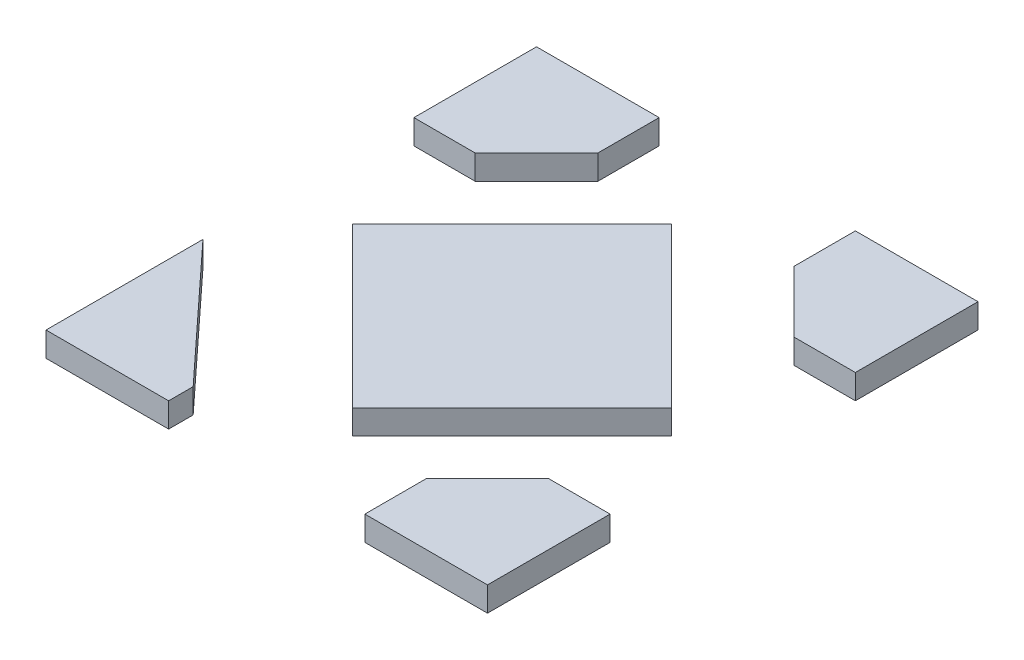
ISO-10303-21;
HEADER;
FILE_DESCRIPTION(('STEP AP214'),'2;1');
FILE_NAME('part.step','',(''),(''),'','','');
FILE_SCHEMA(('AUTOMOTIVE_DESIGN { 1 0 10303 214 1 1 1 1 }'));
ENDSEC;
DATA;
#1=APPLICATION_CONTEXT('core data for automotive mechanical design processes');
#2=APPLICATION_PROTOCOL_DEFINITION('international standard','automotive_design',2000,#1);
#3=PRODUCT_CONTEXT('',#1,'mechanical');
#4=PRODUCT('Part','Part','',(#3));
#5=PRODUCT_RELATED_PRODUCT_CATEGORY('part','',(#4));
#6=PRODUCT_DEFINITION_FORMATION('','',#4);
#7=PRODUCT_DEFINITION_CONTEXT('part definition',#1,'design');
#8=PRODUCT_DEFINITION('design','',#6,#7);
#9=PRODUCT_DEFINITION_SHAPE('','',#8);
#10=(LENGTH_UNIT() NAMED_UNIT(*) SI_UNIT(.MILLI.,.METRE.));
#11=(NAMED_UNIT(*) PLANE_ANGLE_UNIT() SI_UNIT($,.RADIAN.));
#12=(NAMED_UNIT(*) SI_UNIT($,.STERADIAN.) SOLID_ANGLE_UNIT());
#13=UNCERTAINTY_MEASURE_WITH_UNIT(LENGTH_MEASURE(1.E-05),#10,'distance_accuracy_value','');
#14=(GEOMETRIC_REPRESENTATION_CONTEXT(3) GLOBAL_UNCERTAINTY_ASSIGNED_CONTEXT((#13)) GLOBAL_UNIT_ASSIGNED_CONTEXT((#10,
#11,#12)) REPRESENTATION_CONTEXT('',''));
#15=CARTESIAN_POINT('',(0.,0.,0.));
#16=DIRECTION('',(0.,0.,1.));
#17=DIRECTION('',(1.,0.,0.));
#18=AXIS2_PLACEMENT_3D('',#15,#16,#17);
#19=CARTESIAN_POINT('',(-0.2,-0.05,0.450000000000001));
#20=DIRECTION('',(-1.,0.,0.));
#21=DIRECTION('',(0.,0.,1.));
#22=AXIS2_PLACEMENT_3D('',#19,#20,#21);
#23=PLANE('',#22);
#24=DIRECTION('',(0.,0.,1.));
#25=VECTOR('',#24,1.);
#26=CARTESIAN_POINT('',(-0.2,0.,0.450000000000001));
#27=LINE('',#26,#25);
#28=CARTESIAN_POINT('',(-0.2,0.,0.450000000000001));
#29=VERTEX_POINT('',#28);
#30=CARTESIAN_POINT('',(-0.2,0.,0.500000000000001));
#31=VERTEX_POINT('',#30);
#32=EDGE_CURVE('E118',#29,#31,#27,.T.);
#33=ORIENTED_EDGE('',*,*,#32,.T.);
#34=DIRECTION('',(0.,1.,0.));
#35=VECTOR('',#34,1.);
#36=CARTESIAN_POINT('',(-0.2,-0.05,0.500000000000001));
#37=LINE('',#36,#35);
#38=CARTESIAN_POINT('',(-0.2,-0.05,0.500000000000001));
#39=VERTEX_POINT('',#38);
#40=EDGE_CURVE('E12',#39,#31,#37,.T.);
#41=ORIENTED_EDGE('',*,*,#40,.F.);
#42=DIRECTION('',(0.,0.,1.));
#43=VECTOR('',#42,1.);
#44=CARTESIAN_POINT('',(-0.2,-0.05,0.450000000000001));
#45=LINE('',#44,#43);
#46=CARTESIAN_POINT('',(-0.2,-0.05,0.450000000000001));
#47=VERTEX_POINT('',#46);
#48=EDGE_CURVE('E100',#47,#39,#45,.T.);
#49=ORIENTED_EDGE('',*,*,#48,.F.);
#50=DIRECTION('',(0.,1.,0.));
#51=VECTOR('',#50,1.);
#52=CARTESIAN_POINT('',(-0.2,-0.05,0.450000000000001));
#53=LINE('',#52,#51);
#54=EDGE_CURVE('E114',#47,#29,#53,.T.);
#55=ORIENTED_EDGE('',*,*,#54,.T.);
#56=EDGE_LOOP('',(#33,#41,#49,#55));
#57=FACE_BOUND('',#56,.T.);
#58=ADVANCED_FACE('F48',(#57),#23,.F.);
#59=CARTESIAN_POINT('',(-0.45,-0.05,0.500000000000001));
#60=DIRECTION('',(0.,0.,-1.));
#61=DIRECTION('',(-1.,0.,0.));
#62=AXIS2_PLACEMENT_3D('',#59,#60,#61);
#63=PLANE('',#62);
#64=DIRECTION('',(-1.,0.,0.));
#65=VECTOR('',#64,1.);
#66=CARTESIAN_POINT('',(-0.45,0.,0.500000000000001));
#67=LINE('',#66,#65);
#68=CARTESIAN_POINT('',(-0.45,0.,0.500000000000001));
#69=VERTEX_POINT('',#68);
#70=EDGE_CURVE('E105',#31,#69,#67,.T.);
#71=ORIENTED_EDGE('',*,*,#70,.T.);
#72=DIRECTION('',(0.,1.,0.));
#73=VECTOR('',#72,1.);
#74=CARTESIAN_POINT('',(-0.45,-0.05,0.500000000000001));
#75=LINE('',#74,#73);
#76=CARTESIAN_POINT('',(-0.45,-0.05,0.500000000000001));
#77=VERTEX_POINT('',#76);
#78=EDGE_CURVE('E57',#77,#69,#75,.T.);
#79=ORIENTED_EDGE('',*,*,#78,.F.);
#80=DIRECTION('',(-1.,0.,0.));
#81=VECTOR('',#80,1.);
#82=CARTESIAN_POINT('',(-0.45,-0.05,0.500000000000001));
#83=LINE('',#82,#81);
#84=EDGE_CURVE('E95',#39,#77,#83,.T.);
#85=ORIENTED_EDGE('',*,*,#84,.F.);
#86=ORIENTED_EDGE('',*,*,#40,.T.);
#87=EDGE_LOOP('',(#71,#79,#85,#86));
#88=FACE_BOUND('',#87,.T.);
#89=ADVANCED_FACE('F104',(#88),#63,.F.);
#90=CARTESIAN_POINT('',(-0.45,-0.05,0.500000000000001));
#91=DIRECTION('',(1.,0.,0.));
#92=DIRECTION('',(0.,0.,-1.));
#93=AXIS2_PLACEMENT_3D('',#90,#91,#92);
#94=PLANE('',#93);
#95=DIRECTION('',(0.,0.,-1.));
#96=VECTOR('',#95,1.);
#97=CARTESIAN_POINT('',(-0.45,0.,0.500000000000001));
#98=LINE('',#97,#96);
#99=CARTESIAN_POINT('',(-0.449999999999999,0.,0.180000000000001));
#100=VERTEX_POINT('',#99);
#101=EDGE_CURVE('E82',#69,#100,#98,.T.);
#102=ORIENTED_EDGE('',*,*,#101,.T.);
#103=DIRECTION('',(0.,1.,0.));
#104=VECTOR('',#103,1.);
#105=CARTESIAN_POINT('',(-0.449999999999999,-0.05,0.180000000000001));
#106=LINE('',#105,#104);
#107=CARTESIAN_POINT('',(-0.449999999999999,-0.05,0.180000000000001));
#108=VERTEX_POINT('',#107);
#109=EDGE_CURVE('E107',#108,#100,#106,.T.);
#110=ORIENTED_EDGE('',*,*,#109,.F.);
#111=DIRECTION('',(0.,0.,-1.));
#112=VECTOR('',#111,1.);
#113=CARTESIAN_POINT('',(-0.45,-0.05,0.500000000000001));
#114=LINE('',#113,#112);
#115=EDGE_CURVE('E98',#77,#108,#114,.T.);
#116=ORIENTED_EDGE('',*,*,#115,.F.);
#117=ORIENTED_EDGE('',*,*,#78,.T.);
#118=EDGE_LOOP('',(#102,#110,#116,#117));
#119=FACE_BOUND('',#118,.T.);
#120=ADVANCED_FACE('F108',(#119),#94,.F.);
#121=CARTESIAN_POINT('',(-0.449999999999999,-0.05,0.180000000000001));
#122=DIRECTION('',(-0.733760674018171,0.,0.679408031498304));
#123=DIRECTION('',(0.679408031498304,0.,0.733760674018171));
#124=AXIS2_PLACEMENT_3D('',#121,#122,#123);
#125=PLANE('',#124);
#126=DIRECTION('',(0.679408031498303,0.,0.733760674018171));
#127=VECTOR('',#126,1.);
#128=CARTESIAN_POINT('',(-0.449999999999999,0.,0.180000000000001));
#129=LINE('',#128,#127);
#130=EDGE_CURVE('E88',#100,#29,#129,.T.);
#131=ORIENTED_EDGE('',*,*,#130,.T.);
#132=ORIENTED_EDGE('',*,*,#54,.F.);
#133=DIRECTION('',(0.679408031498303,0.,0.733760674018171));
#134=VECTOR('',#133,1.);
#135=CARTESIAN_POINT('',(-0.449999999999999,-0.05,0.180000000000001));
#136=LINE('',#135,#134);
#137=EDGE_CURVE('E65',#108,#47,#136,.T.);
#138=ORIENTED_EDGE('',*,*,#137,.F.);
#139=ORIENTED_EDGE('',*,*,#109,.T.);
#140=EDGE_LOOP('',(#131,#132,#138,#139));
#141=FACE_BOUND('',#140,.T.);
#142=ADVANCED_FACE('F129',(#141),#125,.F.);
#143=CARTESIAN_POINT('',(0.,-0.05,0.));
#144=DIRECTION('',(0.,1.,0.));
#145=DIRECTION('',(0.,0.,1.));
#146=AXIS2_PLACEMENT_3D('',#143,#144,#145);
#147=PLANE('',#146);
#148=ORIENTED_EDGE('',*,*,#48,.T.);
#149=ORIENTED_EDGE('',*,*,#84,.T.);
#150=ORIENTED_EDGE('',*,*,#115,.T.);
#151=ORIENTED_EDGE('',*,*,#137,.T.);
#152=EDGE_LOOP('',(#148,#149,#150,#151));
#153=FACE_BOUND('',#152,.T.);
#154=ADVANCED_FACE('F96',(#153),#147,.F.);
#155=CARTESIAN_POINT('',(0.,0.,0.));
#156=DIRECTION('',(0.,1.,0.));
#157=DIRECTION('',(0.,0.,1.));
#158=AXIS2_PLACEMENT_3D('',#155,#156,#157);
#159=PLANE('',#158);
#160=ORIENTED_EDGE('',*,*,#32,.F.);
#161=ORIENTED_EDGE('',*,*,#130,.F.);
#162=ORIENTED_EDGE('',*,*,#101,.F.);
#163=ORIENTED_EDGE('',*,*,#70,.F.);
#164=EDGE_LOOP('',(#160,#161,#162,#163));
#165=FACE_BOUND('',#164,.T.);
#166=ADVANCED_FACE('F132',(#165),#159,.T.);
#167=CLOSED_SHELL('',(#58,#89,#120,#142,#154,#166));
#168=MANIFOLD_SOLID_BREP('B2',#167);
#169=CARTESIAN_POINT('',(0.45,-0.403553389752961,-0.500000000000001));
#170=DIRECTION('',(-1.,0.,0.));
#171=DIRECTION('',(0.,0.,-1.));
#172=AXIS2_PLACEMENT_3D('',#169,#170,#171);
#173=PLANE('',#172);
#174=DIRECTION('',(0.,0.,-1.));
#175=VECTOR('',#174,1.);
#176=CARTESIAN_POINT('',(0.45,-0.05,-0.500000000000001));
#177=LINE('',#176,#175);
#178=CARTESIAN_POINT('',(0.45,-0.05,-0.250000001188383));
#179=VERTEX_POINT('',#178);
#180=CARTESIAN_POINT('',(0.45,-0.05,-0.500000000000001));
#181=VERTEX_POINT('',#180);
#182=EDGE_CURVE('E276',#179,#181,#177,.T.);
#183=ORIENTED_EDGE('',*,*,#182,.T.);
#184=DIRECTION('',(0.,1.,0.));
#185=VECTOR('',#184,1.);
#186=CARTESIAN_POINT('',(0.45,-0.403553389752961,-0.500000000000001));
#187=LINE('',#186,#185);
#188=CARTESIAN_POINT('',(0.45,0.,-0.500000000000001));
#189=VERTEX_POINT('',#188);
#190=EDGE_CURVE('E285',#181,#189,#187,.T.);
#191=ORIENTED_EDGE('',*,*,#190,.T.);
#192=DIRECTION('',(0.,0.,-1.));
#193=VECTOR('',#192,1.);
#194=CARTESIAN_POINT('',(0.45,0.,-0.500000000000001));
#195=LINE('',#194,#193);
#196=CARTESIAN_POINT('',(0.45,0.,-0.250000001188383));
#197=VERTEX_POINT('',#196);
#198=EDGE_CURVE('E289',#197,#189,#195,.T.);
#199=ORIENTED_EDGE('',*,*,#198,.F.);
#200=DIRECTION('',(0.,1.,0.));
#201=VECTOR('',#200,1.);
#202=CARTESIAN_POINT('',(0.45,-0.403553389752961,-0.250000001188383));
#203=LINE('',#202,#201);
#204=EDGE_CURVE('E204',#179,#197,#203,.T.);
#205=ORIENTED_EDGE('',*,*,#204,.F.);
#206=EDGE_LOOP('',(#183,#191,#199,#205));
#207=FACE_BOUND('',#206,.T.);
#208=ADVANCED_FACE('F200',(#207),#173,.F.);
#209=CARTESIAN_POINT('',(0.2,-0.403553389752961,-0.500000000000001));
#210=DIRECTION('',(0.,0.,1.));
#211=DIRECTION('',(-1.,0.,0.));
#212=AXIS2_PLACEMENT_3D('',#209,#210,#211);
#213=PLANE('',#212);
#214=DIRECTION('',(-1.,0.,0.));
#215=VECTOR('',#214,1.);
#216=CARTESIAN_POINT('',(0.2,-0.05,-0.500000000000001));
#217=LINE('',#216,#215);
#218=CARTESIAN_POINT('',(0.2,-0.05,-0.500000000000001));
#219=VERTEX_POINT('',#218);
#220=EDGE_CURVE('E254',#181,#219,#217,.T.);
#221=ORIENTED_EDGE('',*,*,#220,.T.);
#222=DIRECTION('',(0.,1.,0.));
#223=VECTOR('',#222,1.);
#224=CARTESIAN_POINT('',(0.2,-0.403553389752961,-0.500000000000001));
#225=LINE('',#224,#223);
#226=CARTESIAN_POINT('',(0.2,0.,-0.500000000000001));
#227=VERTEX_POINT('',#226);
#228=EDGE_CURVE('E271',#219,#227,#225,.T.);
#229=ORIENTED_EDGE('',*,*,#228,.T.);
#230=DIRECTION('',(-1.,0.,0.));
#231=VECTOR('',#230,1.);
#232=CARTESIAN_POINT('',(0.2,0.,-0.500000000000001));
#233=LINE('',#232,#231);
#234=EDGE_CURVE('E245',#189,#227,#233,.T.);
#235=ORIENTED_EDGE('',*,*,#234,.F.);
#236=ORIENTED_EDGE('',*,*,#190,.F.);
#237=EDGE_LOOP('',(#221,#229,#235,#236));
#238=FACE_BOUND('',#237,.T.);
#239=ADVANCED_FACE('F306',(#238),#213,.F.);
#240=CARTESIAN_POINT('',(0.2,-0.403553389752961,-0.500000000000001));
#241=DIRECTION('',(1.,0.,0.));
#242=DIRECTION('',(0.,0.,1.));
#243=AXIS2_PLACEMENT_3D('',#240,#241,#242);
#244=PLANE('',#243);
#245=DIRECTION('',(0.,0.,1.));
#246=VECTOR('',#245,1.);
#247=CARTESIAN_POINT('',(0.2,-0.05,-0.500000000000001));
#248=LINE('',#247,#246);
#249=CARTESIAN_POINT('',(0.2,-0.05,-0.375000001188383));
#250=VERTEX_POINT('',#249);
#251=EDGE_CURVE('E210',#219,#250,#248,.T.);
#252=ORIENTED_EDGE('',*,*,#251,.T.);
#253=DIRECTION('',(0.,1.,0.));
#254=VECTOR('',#253,1.);
#255=CARTESIAN_POINT('',(0.2,-0.403553389752961,-0.375000001188383));
#256=LINE('',#255,#254);
#257=CARTESIAN_POINT('',(0.2,0.,-0.375000001188383));
#258=VERTEX_POINT('',#257);
#259=EDGE_CURVE('E262',#250,#258,#256,.T.);
#260=ORIENTED_EDGE('',*,*,#259,.T.);
#261=DIRECTION('',(0.,0.,1.));
#262=VECTOR('',#261,1.);
#263=CARTESIAN_POINT('',(0.2,0.,-0.500000000000001));
#264=LINE('',#263,#262);
#265=EDGE_CURVE('E268',#227,#258,#264,.T.);
#266=ORIENTED_EDGE('',*,*,#265,.F.);
#267=ORIENTED_EDGE('',*,*,#228,.F.);
#268=EDGE_LOOP('',(#252,#260,#266,#267));
#269=FACE_BOUND('',#268,.T.);
#270=ADVANCED_FACE('F270',(#269),#244,.F.);
#271=CARTESIAN_POINT('',(0.2,-0.403553389752961,-0.375000001188383));
#272=DIRECTION('',(0.707106781186549,0.,-0.707106781186546));
#273=DIRECTION('',(0.707106781186546,0.,0.707106781186549));
#274=AXIS2_PLACEMENT_3D('',#271,#272,#273);
#275=PLANE('',#274);
#276=DIRECTION('',(0.707106781186546,0.,0.707106781186549));
#277=VECTOR('',#276,1.);
#278=CARTESIAN_POINT('',(0.2,-0.05,-0.375000001188383));
#279=LINE('',#278,#277);
#280=CARTESIAN_POINT('',(0.325,-0.05,-0.250000001188383));
#281=VERTEX_POINT('',#280);
#282=EDGE_CURVE('E46',#250,#281,#279,.T.);
#283=ORIENTED_EDGE('',*,*,#282,.T.);
#284=DIRECTION('',(0.,1.,0.));
#285=VECTOR('',#284,1.);
#286=CARTESIAN_POINT('',(0.325,-0.403553389752961,-0.250000001188383));
#287=LINE('',#286,#285);
#288=CARTESIAN_POINT('',(0.325,0.,-0.250000001188383));
#289=VERTEX_POINT('',#288);
#290=EDGE_CURVE('E291',#281,#289,#287,.T.);
#291=ORIENTED_EDGE('',*,*,#290,.T.);
#292=DIRECTION('',(0.707106781186546,0.,0.707106781186549));
#293=VECTOR('',#292,1.);
#294=CARTESIAN_POINT('',(0.2,0.,-0.375000001188383));
#295=LINE('',#294,#293);
#296=EDGE_CURVE('E264',#258,#289,#295,.T.);
#297=ORIENTED_EDGE('',*,*,#296,.F.);
#298=ORIENTED_EDGE('',*,*,#259,.F.);
#299=EDGE_LOOP('',(#283,#291,#297,#298));
#300=FACE_BOUND('',#299,.T.);
#301=ADVANCED_FACE('F263',(#300),#275,.F.);
#302=CARTESIAN_POINT('',(0.325,-0.403553389752961,-0.250000001188383));
#303=DIRECTION('',(0.,0.,-1.));
#304=DIRECTION('',(1.,0.,0.));
#305=AXIS2_PLACEMENT_3D('',#302,#303,#304);
#306=PLANE('',#305);
#307=DIRECTION('',(1.,0.,0.));
#308=VECTOR('',#307,1.);
#309=CARTESIAN_POINT('',(0.325,-0.05,-0.250000001188383));
#310=LINE('',#309,#308);
#311=EDGE_CURVE('E218',#281,#179,#310,.T.);
#312=ORIENTED_EDGE('',*,*,#311,.T.);
#313=ORIENTED_EDGE('',*,*,#204,.T.);
#314=DIRECTION('',(1.,0.,0.));
#315=VECTOR('',#314,1.);
#316=CARTESIAN_POINT('',(0.325,0.,-0.250000001188383));
#317=LINE('',#316,#315);
#318=EDGE_CURVE('E224',#289,#197,#317,.T.);
#319=ORIENTED_EDGE('',*,*,#318,.F.);
#320=ORIENTED_EDGE('',*,*,#290,.F.);
#321=EDGE_LOOP('',(#312,#313,#319,#320));
#322=FACE_BOUND('',#321,.T.);
#323=ADVANCED_FACE('F304',(#322),#306,.F.);
#324=CARTESIAN_POINT('',(0.,0.,0.));
#325=DIRECTION('',(0.,-1.,0.));
#326=DIRECTION('',(0.,0.,1.));
#327=AXIS2_PLACEMENT_3D('',#324,#325,#326);
#328=PLANE('',#327);
#329=ORIENTED_EDGE('',*,*,#198,.T.);
#330=ORIENTED_EDGE('',*,*,#234,.T.);
#331=ORIENTED_EDGE('',*,*,#265,.T.);
#332=ORIENTED_EDGE('',*,*,#296,.T.);
#333=ORIENTED_EDGE('',*,*,#318,.T.);
#334=EDGE_LOOP('',(#329,#330,#331,#332,#333));
#335=FACE_BOUND('',#334,.T.);
#336=ADVANCED_FACE('F319',(#335),#328,.F.);
#337=CARTESIAN_POINT('',(0.,-0.05,0.));
#338=DIRECTION('',(0.,-1.,0.));
#339=DIRECTION('',(0.,0.,1.));
#340=AXIS2_PLACEMENT_3D('',#337,#338,#339);
#341=PLANE('',#340);
#342=ORIENTED_EDGE('',*,*,#311,.F.);
#343=ORIENTED_EDGE('',*,*,#282,.F.);
#344=ORIENTED_EDGE('',*,*,#251,.F.);
#345=ORIENTED_EDGE('',*,*,#220,.F.);
#346=ORIENTED_EDGE('',*,*,#182,.F.);
#347=EDGE_LOOP('',(#342,#343,#344,#345,#346));
#348=FACE_BOUND('',#347,.T.);
#349=ADVANCED_FACE('F202',(#348),#341,.T.);
#350=CLOSED_SHELL('',(#208,#239,#270,#301,#323,#336,#349));
#351=MANIFOLD_SOLID_BREP('B6',#350);
#352=CARTESIAN_POINT('',(-0.450000000000005,-0.403553389752961,-0.499999999999997));
#353=DIRECTION('',(1.,0.,0.));
#354=DIRECTION('',(0.,0.,-1.));
#355=AXIS2_PLACEMENT_3D('',#352,#353,#354);
#356=PLANE('',#355);
#357=DIRECTION('',(0.,0.,-1.));
#358=VECTOR('',#357,1.);
#359=CARTESIAN_POINT('',(-0.450000000000005,-0.05,-0.499999999999997));
#360=LINE('',#359,#358);
#361=CARTESIAN_POINT('',(-0.450000000000002,-0.05,-0.250000001188379));
#362=VERTEX_POINT('',#361);
#363=CARTESIAN_POINT('',(-0.450000000000005,-0.05,-0.499999999999997));
#364=VERTEX_POINT('',#363);
#365=EDGE_CURVE('E456',#362,#364,#360,.T.);
#366=ORIENTED_EDGE('',*,*,#365,.F.);
#367=DIRECTION('',(0.,1.,0.));
#368=VECTOR('',#367,1.);
#369=CARTESIAN_POINT('',(-0.450000000000002,-0.403553389752961,-0.250000001188379));
#370=LINE('',#369,#368);
#371=CARTESIAN_POINT('',(-0.450000000000002,0.,-0.250000001188379));
#372=VERTEX_POINT('',#371);
#373=EDGE_CURVE('E386',#362,#372,#370,.T.);
#374=ORIENTED_EDGE('',*,*,#373,.T.);
#375=DIRECTION('',(0.,0.,-1.));
#376=VECTOR('',#375,1.);
#377=CARTESIAN_POINT('',(-0.450000000000005,0.,-0.499999999999997));
#378=LINE('',#377,#376);
#379=CARTESIAN_POINT('',(-0.450000000000005,0.,-0.499999999999997));
#380=VERTEX_POINT('',#379);
#381=EDGE_CURVE('E469',#372,#380,#378,.T.);
#382=ORIENTED_EDGE('',*,*,#381,.T.);
#383=DIRECTION('',(0.,1.,0.));
#384=VECTOR('',#383,1.);
#385=CARTESIAN_POINT('',(-0.450000000000005,-0.403553389752961,-0.499999999999997));
#386=LINE('',#385,#384);
#387=EDGE_CURVE('E426',#364,#380,#386,.T.);
#388=ORIENTED_EDGE('',*,*,#387,.F.);
#389=EDGE_LOOP('',(#366,#374,#382,#388));
#390=FACE_BOUND('',#389,.T.);
#391=ADVANCED_FACE('F382',(#390),#356,.F.);
#392=CARTESIAN_POINT('',(-0.200000000000004,-0.403553389752961,-0.499999999999999));
#393=DIRECTION('',(0.,0.,1.));
#394=DIRECTION('',(1.,0.,0.));
#395=AXIS2_PLACEMENT_3D('',#392,#393,#394);
#396=PLANE('',#395);
#397=DIRECTION('',(1.,0.,0.));
#398=VECTOR('',#397,1.);
#399=CARTESIAN_POINT('',(-0.200000000000004,-0.05,-0.499999999999999));
#400=LINE('',#399,#398);
#401=CARTESIAN_POINT('',(-0.200000000000004,-0.05,-0.499999999999999));
#402=VERTEX_POINT('',#401);
#403=EDGE_CURVE('E433',#364,#402,#400,.T.);
#404=ORIENTED_EDGE('',*,*,#403,.F.);
#405=ORIENTED_EDGE('',*,*,#387,.T.);
#406=DIRECTION('',(1.,0.,0.));
#407=VECTOR('',#406,1.);
#408=CARTESIAN_POINT('',(-0.200000000000004,0.,-0.499999999999999));
#409=LINE('',#408,#407);
#410=CARTESIAN_POINT('',(-0.200000000000004,0.,-0.499999999999999));
#411=VERTEX_POINT('',#410);
#412=EDGE_CURVE('E468',#380,#411,#409,.T.);
#413=ORIENTED_EDGE('',*,*,#412,.T.);
#414=DIRECTION('',(0.,1.,0.));
#415=VECTOR('',#414,1.);
#416=CARTESIAN_POINT('',(-0.200000000000004,-0.403553389752961,-0.499999999999999));
#417=LINE('',#416,#415);
#418=EDGE_CURVE('E470',#402,#411,#417,.T.);
#419=ORIENTED_EDGE('',*,*,#418,.F.);
#420=EDGE_LOOP('',(#404,#405,#413,#419));
#421=FACE_BOUND('',#420,.T.);
#422=ADVANCED_FACE('F489',(#421),#396,.F.);
#423=CARTESIAN_POINT('',(-0.200000000000004,-0.403553389752961,-0.499999999999999));
#424=DIRECTION('',(-1.,0.,0.));
#425=DIRECTION('',(0.,0.,1.));
#426=AXIS2_PLACEMENT_3D('',#423,#424,#425);
#427=PLANE('',#426);
#428=DIRECTION('',(0.,0.,1.));
#429=VECTOR('',#428,1.);
#430=CARTESIAN_POINT('',(-0.200000000000004,-0.05,-0.499999999999999));
#431=LINE('',#430,#429);
#432=CARTESIAN_POINT('',(-0.200000000000003,-0.05,-0.375000001188381));
#433=VERTEX_POINT('',#432);
#434=EDGE_CURVE('E392',#402,#433,#431,.T.);
#435=ORIENTED_EDGE('',*,*,#434,.F.);
#436=ORIENTED_EDGE('',*,*,#418,.T.);
#437=DIRECTION('',(0.,0.,1.));
#438=VECTOR('',#437,1.);
#439=CARTESIAN_POINT('',(-0.200000000000004,0.,-0.499999999999999));
#440=LINE('',#439,#438);
#441=CARTESIAN_POINT('',(-0.200000000000003,0.,-0.375000001188381));
#442=VERTEX_POINT('',#441);
#443=EDGE_CURVE('E446',#411,#442,#440,.T.);
#444=ORIENTED_EDGE('',*,*,#443,.T.);
#445=DIRECTION('',(0.,1.,0.));
#446=VECTOR('',#445,1.);
#447=CARTESIAN_POINT('',(-0.200000000000003,-0.403553389752961,-0.375000001188381));
#448=LINE('',#447,#446);
#449=EDGE_CURVE('E438',#433,#442,#448,.T.);
#450=ORIENTED_EDGE('',*,*,#449,.F.);
#451=EDGE_LOOP('',(#435,#436,#444,#450));
#452=FACE_BOUND('',#451,.T.);
#453=ADVANCED_FACE('F444',(#452),#427,.F.);
#454=CARTESIAN_POINT('',(-0.200000000000003,-0.403553389752961,-0.375000001188381));
#455=DIRECTION('',(-0.707106781186555,0.,-0.70710678118654));
#456=DIRECTION('',(-0.70710678118654,0.,0.707106781186555));
#457=AXIS2_PLACEMENT_3D('',#454,#455,#456);
#458=PLANE('',#457);
#459=DIRECTION('',(-0.70710678118654,0.,0.707106781186555));
#460=VECTOR('',#459,1.);
#461=CARTESIAN_POINT('',(-0.200000000000003,-0.05,-0.375000001188381));
#462=LINE('',#461,#460);
#463=CARTESIAN_POINT('',(-0.325000000000002,-0.05,-0.25000000118838));
#464=VERTEX_POINT('',#463);
#465=EDGE_CURVE('E198',#433,#464,#462,.T.);
#466=ORIENTED_EDGE('',*,*,#465,.F.);
#467=ORIENTED_EDGE('',*,*,#449,.T.);
#468=DIRECTION('',(-0.70710678118654,0.,0.707106781186555));
#469=VECTOR('',#468,1.);
#470=CARTESIAN_POINT('',(-0.200000000000003,0.,-0.375000001188381));
#471=LINE('',#470,#469);
#472=CARTESIAN_POINT('',(-0.325000000000002,0.,-0.25000000118838));
#473=VERTEX_POINT('',#472);
#474=EDGE_CURVE('E449',#442,#473,#471,.T.);
#475=ORIENTED_EDGE('',*,*,#474,.T.);
#476=DIRECTION('',(0.,1.,0.));
#477=VECTOR('',#476,1.);
#478=CARTESIAN_POINT('',(-0.325000000000002,-0.403553389752961,-0.25000000118838));
#479=LINE('',#478,#477);
#480=EDGE_CURVE('E405',#464,#473,#479,.T.);
#481=ORIENTED_EDGE('',*,*,#480,.F.);
#482=EDGE_LOOP('',(#466,#467,#475,#481));
#483=FACE_BOUND('',#482,.T.);
#484=ADVANCED_FACE('F437',(#483),#458,.F.);
#485=CARTESIAN_POINT('',(-0.325000000000002,-0.403553389752961,-0.25000000118838));
#486=DIRECTION('',(0.,0.,-1.));
#487=DIRECTION('',(-1.,0.,0.));
#488=AXIS2_PLACEMENT_3D('',#485,#486,#487);
#489=PLANE('',#488);
#490=DIRECTION('',(-1.,0.,0.));
#491=VECTOR('',#490,1.);
#492=CARTESIAN_POINT('',(-0.325000000000002,-0.05,-0.25000000118838));
#493=LINE('',#492,#491);
#494=EDGE_CURVE('E462',#464,#362,#493,.T.);
#495=ORIENTED_EDGE('',*,*,#494,.F.);
#496=ORIENTED_EDGE('',*,*,#480,.T.);
#497=DIRECTION('',(-1.,0.,0.));
#498=VECTOR('',#497,1.);
#499=CARTESIAN_POINT('',(-0.325000000000002,0.,-0.25000000118838));
#500=LINE('',#499,#498);
#501=EDGE_CURVE('E465',#473,#372,#500,.T.);
#502=ORIENTED_EDGE('',*,*,#501,.T.);
#503=ORIENTED_EDGE('',*,*,#373,.F.);
#504=EDGE_LOOP('',(#495,#496,#502,#503));
#505=FACE_BOUND('',#504,.T.);
#506=ADVANCED_FACE('F486',(#505),#489,.F.);
#507=CARTESIAN_POINT('',(0.,0.,0.));
#508=DIRECTION('',(0.,-1.,0.));
#509=DIRECTION('',(0.,0.,1.));
#510=AXIS2_PLACEMENT_3D('',#507,#508,#509);
#511=PLANE('',#510);
#512=ORIENTED_EDGE('',*,*,#381,.F.);
#513=ORIENTED_EDGE('',*,*,#501,.F.);
#514=ORIENTED_EDGE('',*,*,#474,.F.);
#515=ORIENTED_EDGE('',*,*,#443,.F.);
#516=ORIENTED_EDGE('',*,*,#412,.F.);
#517=EDGE_LOOP('',(#512,#513,#514,#515,#516));
#518=FACE_BOUND('',#517,.T.);
#519=ADVANCED_FACE('F488',(#518),#511,.F.);
#520=CARTESIAN_POINT('',(0.,-0.05,0.));
#521=DIRECTION('',(0.,-1.,0.));
#522=DIRECTION('',(0.,0.,1.));
#523=AXIS2_PLACEMENT_3D('',#520,#521,#522);
#524=PLANE('',#523);
#525=ORIENTED_EDGE('',*,*,#494,.T.);
#526=ORIENTED_EDGE('',*,*,#365,.T.);
#527=ORIENTED_EDGE('',*,*,#403,.T.);
#528=ORIENTED_EDGE('',*,*,#434,.T.);
#529=ORIENTED_EDGE('',*,*,#465,.T.);
#530=EDGE_LOOP('',(#525,#526,#527,#528,#529));
#531=FACE_BOUND('',#530,.T.);
#532=ADVANCED_FACE('F384',(#531),#524,.T.);
#533=CLOSED_SHELL('',(#391,#422,#453,#484,#506,#519,#532));
#534=MANIFOLD_SOLID_BREP('B40',#533);
#535=CARTESIAN_POINT('',(0.45,-0.403553389752961,0.500000000000001));
#536=DIRECTION('',(-1.,0.,0.));
#537=DIRECTION('',(0.,0.,1.));
#538=AXIS2_PLACEMENT_3D('',#535,#536,#537);
#539=PLANE('',#538);
#540=DIRECTION('',(0.,0.,1.));
#541=VECTOR('',#540,1.);
#542=CARTESIAN_POINT('',(0.45,-0.05,0.500000000000001));
#543=LINE('',#542,#541);
#544=CARTESIAN_POINT('',(0.45,-0.05,0.250000001188383));
#545=VERTEX_POINT('',#544);
#546=CARTESIAN_POINT('',(0.45,-0.05,0.500000000000001));
#547=VERTEX_POINT('',#546);
#548=EDGE_CURVE('E638',#545,#547,#543,.T.);
#549=ORIENTED_EDGE('',*,*,#548,.F.);
#550=DIRECTION('',(0.,1.,0.));
#551=VECTOR('',#550,1.);
#552=CARTESIAN_POINT('',(0.45,-0.403553389752961,0.250000001188383));
#553=LINE('',#552,#551);
#554=CARTESIAN_POINT('',(0.45,0.,0.250000001188383));
#555=VERTEX_POINT('',#554);
#556=EDGE_CURVE('E567',#545,#555,#553,.T.);
#557=ORIENTED_EDGE('',*,*,#556,.T.);
#558=DIRECTION('',(0.,0.,1.));
#559=VECTOR('',#558,1.);
#560=CARTESIAN_POINT('',(0.45,0.,0.500000000000001));
#561=LINE('',#560,#559);
#562=CARTESIAN_POINT('',(0.45,0.,0.500000000000001));
#563=VERTEX_POINT('',#562);
#564=EDGE_CURVE('E650',#555,#563,#561,.T.);
#565=ORIENTED_EDGE('',*,*,#564,.T.);
#566=DIRECTION('',(0.,1.,0.));
#567=VECTOR('',#566,1.);
#568=CARTESIAN_POINT('',(0.45,-0.403553389752961,0.500000000000001));
#569=LINE('',#568,#567);
#570=EDGE_CURVE('E607',#547,#563,#569,.T.);
#571=ORIENTED_EDGE('',*,*,#570,.F.);
#572=EDGE_LOOP('',(#549,#557,#565,#571));
#573=FACE_BOUND('',#572,.T.);
#574=ADVANCED_FACE('F563',(#573),#539,.F.);
#575=CARTESIAN_POINT('',(0.2,-0.403553389752961,0.500000000000001));
#576=DIRECTION('',(0.,0.,-1.));
#577=DIRECTION('',(-1.,0.,0.));
#578=AXIS2_PLACEMENT_3D('',#575,#576,#577);
#579=PLANE('',#578);
#580=DIRECTION('',(-1.,0.,0.));
#581=VECTOR('',#580,1.);
#582=CARTESIAN_POINT('',(0.2,-0.05,0.500000000000001));
#583=LINE('',#582,#581);
#584=CARTESIAN_POINT('',(0.2,-0.05,0.500000000000001));
#585=VERTEX_POINT('',#584);
#586=EDGE_CURVE('E614',#547,#585,#583,.T.);
#587=ORIENTED_EDGE('',*,*,#586,.F.);
#588=ORIENTED_EDGE('',*,*,#570,.T.);
#589=DIRECTION('',(-1.,0.,0.));
#590=VECTOR('',#589,1.);
#591=CARTESIAN_POINT('',(0.2,0.,0.500000000000001));
#592=LINE('',#591,#590);
#593=CARTESIAN_POINT('',(0.2,0.,0.500000000000001));
#594=VERTEX_POINT('',#593);
#595=EDGE_CURVE('E649',#563,#594,#592,.T.);
#596=ORIENTED_EDGE('',*,*,#595,.T.);
#597=DIRECTION('',(0.,1.,0.));
#598=VECTOR('',#597,1.);
#599=CARTESIAN_POINT('',(0.2,-0.403553389752961,0.500000000000001));
#600=LINE('',#599,#598);
#601=EDGE_CURVE('E651',#585,#594,#600,.T.);
#602=ORIENTED_EDGE('',*,*,#601,.F.);
#603=EDGE_LOOP('',(#587,#588,#596,#602));
#604=FACE_BOUND('',#603,.T.);
#605=ADVANCED_FACE('F670',(#604),#579,.F.);
#606=CARTESIAN_POINT('',(0.2,-0.403553389752961,0.500000000000001));
#607=DIRECTION('',(1.,0.,0.));
#608=DIRECTION('',(0.,0.,-1.));
#609=AXIS2_PLACEMENT_3D('',#606,#607,#608);
#610=PLANE('',#609);
#611=DIRECTION('',(0.,0.,-1.));
#612=VECTOR('',#611,1.);
#613=CARTESIAN_POINT('',(0.2,-0.05,0.500000000000001));
#614=LINE('',#613,#612);
#615=CARTESIAN_POINT('',(0.2,-0.05,0.375000001188383));
#616=VERTEX_POINT('',#615);
#617=EDGE_CURVE('E573',#585,#616,#614,.T.);
#618=ORIENTED_EDGE('',*,*,#617,.F.);
#619=ORIENTED_EDGE('',*,*,#601,.T.);
#620=DIRECTION('',(0.,0.,-1.));
#621=VECTOR('',#620,1.);
#622=CARTESIAN_POINT('',(0.2,0.,0.500000000000001));
#623=LINE('',#622,#621);
#624=CARTESIAN_POINT('',(0.2,0.,0.375000001188383));
#625=VERTEX_POINT('',#624);
#626=EDGE_CURVE('E627',#594,#625,#623,.T.);
#627=ORIENTED_EDGE('',*,*,#626,.T.);
#628=DIRECTION('',(0.,1.,0.));
#629=VECTOR('',#628,1.);
#630=CARTESIAN_POINT('',(0.2,-0.403553389752961,0.375000001188383));
#631=LINE('',#630,#629);
#632=EDGE_CURVE('E619',#616,#625,#631,.T.);
#633=ORIENTED_EDGE('',*,*,#632,.F.);
#634=EDGE_LOOP('',(#618,#619,#627,#633));
#635=FACE_BOUND('',#634,.T.);
#636=ADVANCED_FACE('F625',(#635),#610,.F.);
#637=CARTESIAN_POINT('',(0.2,-0.403553389752961,0.375000001188383));
#638=DIRECTION('',(0.707106781186549,0.,0.707106781186546));
#639=DIRECTION('',(0.707106781186546,0.,-0.707106781186549));
#640=AXIS2_PLACEMENT_3D('',#637,#638,#639);
#641=PLANE('',#640);
#642=DIRECTION('',(0.707106781186546,0.,-0.707106781186549));
#643=VECTOR('',#642,1.);
#644=CARTESIAN_POINT('',(0.2,-0.05,0.375000001188383));
#645=LINE('',#644,#643);
#646=CARTESIAN_POINT('',(0.325,-0.05,0.250000001188383));
#647=VERTEX_POINT('',#646);
#648=EDGE_CURVE('E380',#616,#647,#645,.T.);
#649=ORIENTED_EDGE('',*,*,#648,.F.);
#650=ORIENTED_EDGE('',*,*,#632,.T.);
#651=DIRECTION('',(0.707106781186546,0.,-0.707106781186549));
#652=VECTOR('',#651,1.);
#653=CARTESIAN_POINT('',(0.2,0.,0.375000001188383));
#654=LINE('',#653,#652);
#655=CARTESIAN_POINT('',(0.325,0.,0.250000001188383));
#656=VERTEX_POINT('',#655);
#657=EDGE_CURVE('E630',#625,#656,#654,.T.);
#658=ORIENTED_EDGE('',*,*,#657,.T.);
#659=DIRECTION('',(0.,1.,0.));
#660=VECTOR('',#659,1.);
#661=CARTESIAN_POINT('',(0.325,-0.403553389752961,0.250000001188383));
#662=LINE('',#661,#660);
#663=EDGE_CURVE('E586',#647,#656,#662,.T.);
#664=ORIENTED_EDGE('',*,*,#663,.F.);
#665=EDGE_LOOP('',(#649,#650,#658,#664));
#666=FACE_BOUND('',#665,.T.);
#667=ADVANCED_FACE('F618',(#666),#641,.F.);
#668=CARTESIAN_POINT('',(0.325,-0.403553389752961,0.250000001188383));
#669=DIRECTION('',(0.,0.,1.));
#670=DIRECTION('',(1.,0.,0.));
#671=AXIS2_PLACEMENT_3D('',#668,#669,#670);
#672=PLANE('',#671);
#673=DIRECTION('',(1.,0.,0.));
#674=VECTOR('',#673,1.);
#675=CARTESIAN_POINT('',(0.325,-0.05,0.250000001188383));
#676=LINE('',#675,#674);
#677=EDGE_CURVE('E644',#647,#545,#676,.T.);
#678=ORIENTED_EDGE('',*,*,#677,.F.);
#679=ORIENTED_EDGE('',*,*,#663,.T.);
#680=DIRECTION('',(1.,0.,0.));
#681=VECTOR('',#680,1.);
#682=CARTESIAN_POINT('',(0.325,0.,0.250000001188383));
#683=LINE('',#682,#681);
#684=EDGE_CURVE('E647',#656,#555,#683,.T.);
#685=ORIENTED_EDGE('',*,*,#684,.T.);
#686=ORIENTED_EDGE('',*,*,#556,.F.);
#687=EDGE_LOOP('',(#678,#679,#685,#686));
#688=FACE_BOUND('',#687,.T.);
#689=ADVANCED_FACE('F667',(#688),#672,.F.);
#690=CARTESIAN_POINT('',(0.,0.,0.));
#691=DIRECTION('',(0.,-1.,0.));
#692=DIRECTION('',(0.,0.,-1.));
#693=AXIS2_PLACEMENT_3D('',#690,#691,#692);
#694=PLANE('',#693);
#695=ORIENTED_EDGE('',*,*,#564,.F.);
#696=ORIENTED_EDGE('',*,*,#684,.F.);
#697=ORIENTED_EDGE('',*,*,#657,.F.);
#698=ORIENTED_EDGE('',*,*,#626,.F.);
#699=ORIENTED_EDGE('',*,*,#595,.F.);
#700=EDGE_LOOP('',(#695,#696,#697,#698,#699));
#701=FACE_BOUND('',#700,.T.);
#702=ADVANCED_FACE('F669',(#701),#694,.F.);
#703=CARTESIAN_POINT('',(0.,-0.05,0.));
#704=DIRECTION('',(0.,-1.,0.));
#705=DIRECTION('',(0.,0.,-1.));
#706=AXIS2_PLACEMENT_3D('',#703,#704,#705);
#707=PLANE('',#706);
#708=ORIENTED_EDGE('',*,*,#677,.T.);
#709=ORIENTED_EDGE('',*,*,#548,.T.);
#710=ORIENTED_EDGE('',*,*,#586,.T.);
#711=ORIENTED_EDGE('',*,*,#617,.T.);
#712=ORIENTED_EDGE('',*,*,#648,.T.);
#713=EDGE_LOOP('',(#708,#709,#710,#711,#712));
#714=FACE_BOUND('',#713,.T.);
#715=ADVANCED_FACE('F565',(#714),#707,.T.);
#716=CLOSED_SHELL('',(#574,#605,#636,#667,#689,#702,#715));
#717=MANIFOLD_SOLID_BREP('B192',#716);
#718=CARTESIAN_POINT('',(-0.325,-0.05,0.));
#719=DIRECTION('',(0.707106781186546,0.,0.707106781186549));
#720=DIRECTION('',(0.707106781186549,0.,-0.707106781186546));
#721=AXIS2_PLACEMENT_3D('',#718,#719,#720);
#722=PLANE('',#721);
#723=DIRECTION('',(0.707106781186549,0.,-0.707106781186546));
#724=VECTOR('',#723,1.);
#725=CARTESIAN_POINT('',(-0.325,0.,0.));
#726=LINE('',#725,#724);
#727=CARTESIAN_POINT('',(-0.325,0.,0.));
#728=VERTEX_POINT('',#727);
#729=CARTESIAN_POINT('',(0.,0.,-0.325));
#730=VERTEX_POINT('',#729);
#731=EDGE_CURVE('E805',#728,#730,#726,.T.);
#732=ORIENTED_EDGE('',*,*,#731,.T.);
#733=DIRECTION('',(0.,1.,0.));
#734=VECTOR('',#733,1.);
#735=CARTESIAN_POINT('',(0.,-0.05,-0.325));
#736=LINE('',#735,#734);
#737=CARTESIAN_POINT('',(0.,-0.05,-0.325));
#738=VERTEX_POINT('',#737);
#739=EDGE_CURVE('E561',#738,#730,#736,.T.);
#740=ORIENTED_EDGE('',*,*,#739,.F.);
#741=DIRECTION('',(0.707106781186549,0.,-0.707106781186546));
#742=VECTOR('',#741,1.);
#743=CARTESIAN_POINT('',(-0.325,-0.05,0.));
#744=LINE('',#743,#742);
#745=CARTESIAN_POINT('',(-0.325,-0.05,0.));
#746=VERTEX_POINT('',#745);
#747=EDGE_CURVE('E787',#746,#738,#744,.T.);
#748=ORIENTED_EDGE('',*,*,#747,.F.);
#749=DIRECTION('',(0.,1.,0.));
#750=VECTOR('',#749,1.);
#751=CARTESIAN_POINT('',(-0.325,-0.05,0.));
#752=LINE('',#751,#750);
#753=EDGE_CURVE('E801',#746,#728,#752,.T.);
#754=ORIENTED_EDGE('',*,*,#753,.T.);
#755=EDGE_LOOP('',(#732,#740,#748,#754));
#756=FACE_BOUND('',#755,.T.);
#757=ADVANCED_FACE('F735',(#756),#722,.F.);
#758=CARTESIAN_POINT('',(0.,-0.05,-0.325));
#759=DIRECTION('',(-0.707106781186549,0.,0.707106781186546));
#760=DIRECTION('',(0.707106781186546,0.,0.707106781186549));
#761=AXIS2_PLACEMENT_3D('',#758,#759,#760);
#762=PLANE('',#761);
#763=DIRECTION('',(0.707106781186546,0.,0.707106781186549));
#764=VECTOR('',#763,1.);
#765=CARTESIAN_POINT('',(0.,0.,-0.325));
#766=LINE('',#765,#764);
#767=CARTESIAN_POINT('',(0.325,0.,0.));
#768=VERTEX_POINT('',#767);
#769=EDGE_CURVE('E792',#730,#768,#766,.T.);
#770=ORIENTED_EDGE('',*,*,#769,.T.);
#771=DIRECTION('',(0.,1.,0.));
#772=VECTOR('',#771,1.);
#773=CARTESIAN_POINT('',(0.325,-0.05,0.));
#774=LINE('',#773,#772);
#775=CARTESIAN_POINT('',(0.325,-0.05,0.));
#776=VERTEX_POINT('',#775);
#777=EDGE_CURVE('E744',#776,#768,#774,.T.);
#778=ORIENTED_EDGE('',*,*,#777,.F.);
#779=DIRECTION('',(0.707106781186546,0.,0.707106781186549));
#780=VECTOR('',#779,1.);
#781=CARTESIAN_POINT('',(0.,-0.05,-0.325));
#782=LINE('',#781,#780);
#783=EDGE_CURVE('E782',#738,#776,#782,.T.);
#784=ORIENTED_EDGE('',*,*,#783,.F.);
#785=ORIENTED_EDGE('',*,*,#739,.T.);
#786=EDGE_LOOP('',(#770,#778,#784,#785));
#787=FACE_BOUND('',#786,.T.);
#788=ADVANCED_FACE('F791',(#787),#762,.F.);
#789=CARTESIAN_POINT('',(0.325,-0.05,0.));
#790=DIRECTION('',(-0.707106781186546,0.,-0.707106781186549));
#791=DIRECTION('',(-0.707106781186549,0.,0.707106781186546));
#792=AXIS2_PLACEMENT_3D('',#789,#790,#791);
#793=PLANE('',#792);
#794=DIRECTION('',(-0.707106781186549,0.,0.707106781186546));
#795=VECTOR('',#794,1.);
#796=CARTESIAN_POINT('',(0.325,0.,0.));
#797=LINE('',#796,#795);
#798=CARTESIAN_POINT('',(0.,0.,0.325));
#799=VERTEX_POINT('',#798);
#800=EDGE_CURVE('E769',#768,#799,#797,.T.);
#801=ORIENTED_EDGE('',*,*,#800,.T.);
#802=DIRECTION('',(0.,1.,0.));
#803=VECTOR('',#802,1.);
#804=CARTESIAN_POINT('',(0.,-0.05,0.325));
#805=LINE('',#804,#803);
#806=CARTESIAN_POINT('',(0.,-0.05,0.325));
#807=VERTEX_POINT('',#806);
#808=EDGE_CURVE('E794',#807,#799,#805,.T.);
#809=ORIENTED_EDGE('',*,*,#808,.F.);
#810=DIRECTION('',(-0.707106781186549,0.,0.707106781186546));
#811=VECTOR('',#810,1.);
#812=CARTESIAN_POINT('',(0.325,-0.05,0.));
#813=LINE('',#812,#811);
#814=EDGE_CURVE('E785',#776,#807,#813,.T.);
#815=ORIENTED_EDGE('',*,*,#814,.F.);
#816=ORIENTED_EDGE('',*,*,#777,.T.);
#817=EDGE_LOOP('',(#801,#809,#815,#816));
#818=FACE_BOUND('',#817,.T.);
#819=ADVANCED_FACE('F795',(#818),#793,.F.);
#820=CARTESIAN_POINT('',(0.,-0.05,0.325));
#821=DIRECTION('',(0.707106781186549,0.,-0.707106781186546));
#822=DIRECTION('',(-0.707106781186546,0.,-0.707106781186549));
#823=AXIS2_PLACEMENT_3D('',#820,#821,#822);
#824=PLANE('',#823);
#825=DIRECTION('',(-0.707106781186546,0.,-0.707106781186549));
#826=VECTOR('',#825,1.);
#827=CARTESIAN_POINT('',(0.,0.,0.325));
#828=LINE('',#827,#826);
#829=EDGE_CURVE('E775',#799,#728,#828,.T.);
#830=ORIENTED_EDGE('',*,*,#829,.T.);
#831=ORIENTED_EDGE('',*,*,#753,.F.);
#832=DIRECTION('',(-0.707106781186546,0.,-0.707106781186549));
#833=VECTOR('',#832,1.);
#834=CARTESIAN_POINT('',(0.,-0.05,0.325));
#835=LINE('',#834,#833);
#836=EDGE_CURVE('E752',#807,#746,#835,.T.);
#837=ORIENTED_EDGE('',*,*,#836,.F.);
#838=ORIENTED_EDGE('',*,*,#808,.T.);
#839=EDGE_LOOP('',(#830,#831,#837,#838));
#840=FACE_BOUND('',#839,.T.);
#841=ADVANCED_FACE('F817',(#840),#824,.F.);
#842=CARTESIAN_POINT('',(0.,-0.05,0.));
#843=DIRECTION('',(0.,-1.,0.));
#844=DIRECTION('',(0.,0.,-1.));
#845=AXIS2_PLACEMENT_3D('',#842,#843,#844);
#846=PLANE('',#845);
#847=ORIENTED_EDGE('',*,*,#747,.T.);
#848=ORIENTED_EDGE('',*,*,#783,.T.);
#849=ORIENTED_EDGE('',*,*,#814,.T.);
#850=ORIENTED_EDGE('',*,*,#836,.T.);
#851=EDGE_LOOP('',(#847,#848,#849,#850));
#852=FACE_BOUND('',#851,.T.);
#853=ADVANCED_FACE('F783',(#852),#846,.T.);
#854=CARTESIAN_POINT('',(0.,0.,0.));
#855=DIRECTION('',(0.,-1.,0.));
#856=DIRECTION('',(0.,0.,-1.));
#857=AXIS2_PLACEMENT_3D('',#854,#855,#856);
#858=PLANE('',#857);
#859=ORIENTED_EDGE('',*,*,#731,.F.);
#860=ORIENTED_EDGE('',*,*,#829,.F.);
#861=ORIENTED_EDGE('',*,*,#800,.F.);
#862=ORIENTED_EDGE('',*,*,#769,.F.);
#863=EDGE_LOOP('',(#859,#860,#861,#862));
#864=FACE_BOUND('',#863,.T.);
#865=ADVANCED_FACE('F820',(#864),#858,.F.);
#866=CLOSED_SHELL('',(#757,#788,#819,#841,#853,#865));
#867=MANIFOLD_SOLID_BREP('B374',#866);
#868=ADVANCED_BREP_SHAPE_REPRESENTATION('',(#18,#168,#351,#534,#717,#867),#14);
#869=SHAPE_DEFINITION_REPRESENTATION(#9,#868);
ENDSEC;
END-ISO-10303-21;
